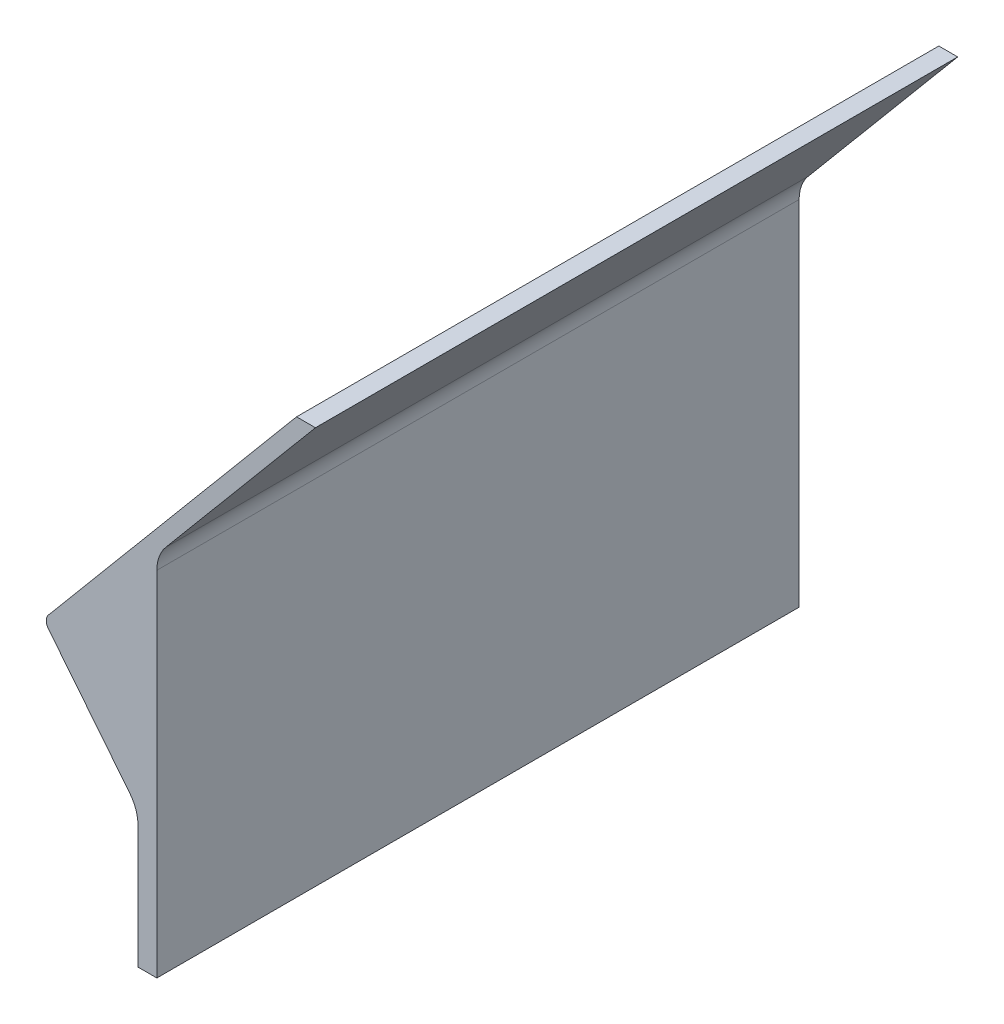
ISO-10303-21;
HEADER;
FILE_DESCRIPTION(('STEP AP214'),'2;1');
FILE_NAME('part.step','',(''),(''),'','','');
FILE_SCHEMA(('AUTOMOTIVE_DESIGN { 1 0 10303 214 1 1 1 1 }'));
ENDSEC;
DATA;
#1=APPLICATION_CONTEXT('core data for automotive mechanical design processes');
#2=APPLICATION_PROTOCOL_DEFINITION('international standard','automotive_design',2000,#1);
#3=PRODUCT_CONTEXT('',#1,'mechanical');
#4=PRODUCT('Part','Part','',(#3));
#5=PRODUCT_RELATED_PRODUCT_CATEGORY('part','',(#4));
#6=PRODUCT_DEFINITION_FORMATION('','',#4);
#7=PRODUCT_DEFINITION_CONTEXT('part definition',#1,'design');
#8=PRODUCT_DEFINITION('design','',#6,#7);
#9=PRODUCT_DEFINITION_SHAPE('','',#8);
#10=(LENGTH_UNIT() NAMED_UNIT(*) SI_UNIT(.MILLI.,.METRE.));
#11=(NAMED_UNIT(*) PLANE_ANGLE_UNIT() SI_UNIT($,.RADIAN.));
#12=(NAMED_UNIT(*) SI_UNIT($,.STERADIAN.) SOLID_ANGLE_UNIT());
#13=UNCERTAINTY_MEASURE_WITH_UNIT(LENGTH_MEASURE(1.E-05),#10,'distance_accuracy_value','');
#14=(GEOMETRIC_REPRESENTATION_CONTEXT(3) GLOBAL_UNCERTAINTY_ASSIGNED_CONTEXT((#13)) GLOBAL_UNIT_ASSIGNED_CONTEXT((#10,
#11,#12)) REPRESENTATION_CONTEXT('',''));
#15=CARTESIAN_POINT('',(0.,0.,0.));
#16=DIRECTION('',(0.,0.,1.));
#17=DIRECTION('',(1.,0.,0.));
#18=AXIS2_PLACEMENT_3D('',#15,#16,#17);
#19=CARTESIAN_POINT('',(-5.,0.,170.));
#20=DIRECTION('',(0.,1.,0.));
#21=DIRECTION('',(-1.,0.,0.));
#22=AXIS2_PLACEMENT_3D('',#19,#20,#21);
#23=PLANE('',#22);
#24=DIRECTION('',(1.,0.,0.));
#25=VECTOR('',#24,1.);
#26=CARTESIAN_POINT('',(-5.,0.,0.));
#27=LINE('',#26,#25);
#28=CARTESIAN_POINT('',(-5.,0.,0.));
#29=VERTEX_POINT('',#28);
#30=CARTESIAN_POINT('',(0.,0.,0.));
#31=VERTEX_POINT('',#30);
#32=EDGE_CURVE('E143',#29,#31,#27,.T.);
#33=ORIENTED_EDGE('',*,*,#32,.T.);
#34=DIRECTION('',(0.,0.,-1.));
#35=VECTOR('',#34,1.);
#36=CARTESIAN_POINT('',(0.,0.,170.));
#37=LINE('',#36,#35);
#38=CARTESIAN_POINT('',(0.,0.,170.));
#39=VERTEX_POINT('',#38);
#40=EDGE_CURVE('E122',#39,#31,#37,.T.);
#41=ORIENTED_EDGE('',*,*,#40,.F.);
#42=DIRECTION('',(1.,0.,0.));
#43=VECTOR('',#42,1.);
#44=CARTESIAN_POINT('',(-5.,0.,170.));
#45=LINE('',#44,#43);
#46=CARTESIAN_POINT('',(-5.,0.,170.));
#47=VERTEX_POINT('',#46);
#48=EDGE_CURVE('E130',#47,#39,#45,.T.);
#49=ORIENTED_EDGE('',*,*,#48,.F.);
#50=DIRECTION('',(0.,0.,-1.));
#51=VECTOR('',#50,1.);
#52=CARTESIAN_POINT('',(-5.,0.,170.));
#53=LINE('',#52,#51);
#54=EDGE_CURVE('E207',#47,#29,#53,.T.);
#55=ORIENTED_EDGE('',*,*,#54,.T.);
#56=EDGE_LOOP('',(#33,#41,#49,#55));
#57=FACE_BOUND('',#56,.T.);
#58=ADVANCED_FACE('F39',(#57),#23,.F.);
#59=CARTESIAN_POINT('',(0.,0.,170.));
#60=DIRECTION('',(-1.,0.,0.));
#61=DIRECTION('',(0.,0.,1.));
#62=AXIS2_PLACEMENT_3D('',#59,#60,#61);
#63=PLANE('',#62);
#64=DIRECTION('',(0.,1.,0.));
#65=VECTOR('',#64,1.);
#66=CARTESIAN_POINT('',(0.,0.,0.));
#67=LINE('',#66,#65);
#68=CARTESIAN_POINT('',(0.,93.460297657338,0.));
#69=VERTEX_POINT('',#68);
#70=EDGE_CURVE('E221',#31,#69,#67,.T.);
#71=ORIENTED_EDGE('',*,*,#70,.T.);
#72=DIRECTION('',(0.,0.,-1.));
#73=VECTOR('',#72,1.);
#74=CARTESIAN_POINT('',(0.,93.460297657338,170.));
#75=LINE('',#74,#73);
#76=CARTESIAN_POINT('',(0.,93.460297657338,170.));
#77=VERTEX_POINT('',#76);
#78=EDGE_CURVE('E125',#69,#77,#75,.F.);
#79=ORIENTED_EDGE('',*,*,#78,.T.);
#80=DIRECTION('',(0.,1.,0.));
#81=VECTOR('',#80,1.);
#82=CARTESIAN_POINT('',(0.,0.,170.));
#83=LINE('',#82,#81);
#84=EDGE_CURVE('E117',#39,#77,#83,.T.);
#85=ORIENTED_EDGE('',*,*,#84,.F.);
#86=ORIENTED_EDGE('',*,*,#40,.T.);
#87=EDGE_LOOP('',(#71,#79,#85,#86));
#88=FACE_BOUND('',#87,.T.);
#89=ADVANCED_FACE('F120',(#88),#63,.F.);
#90=CARTESIAN_POINT('',(0.,97.1,170.));
#91=DIRECTION('',(-0.766044443118977,0.64278760968654,0.));
#92=DIRECTION('',(-0.64278760968654,-0.766044443118977,0.));
#93=AXIS2_PLACEMENT_3D('',#90,#91,#92);
#94=PLANE('',#93);
#95=DIRECTION('',(0.64278760968654,0.766044443118977,0.));
#96=VECTOR('',#95,1.);
#97=CARTESIAN_POINT('',(0.,97.1,170.));
#98=LINE('',#97,#96);
#99=CARTESIAN_POINT('',(2.33955556881022,99.8881737542034,170.));
#100=VERTEX_POINT('',#99);
#101=CARTESIAN_POINT('',(41.9740309125311,147.122702135669,170.));
#102=VERTEX_POINT('',#101);
#103=EDGE_CURVE('E129',#100,#102,#98,.T.);
#104=ORIENTED_EDGE('',*,*,#103,.F.);
#105=DIRECTION('',(0.,0.,-1.));
#106=VECTOR('',#105,1.);
#107=CARTESIAN_POINT('',(2.33955556881022,99.8881737542034,0.));
#108=LINE('',#107,#106);
#109=CARTESIAN_POINT('',(2.33955556881022,99.8881737542034,0.));
#110=VERTEX_POINT('',#109);
#111=EDGE_CURVE('E161',#100,#110,#108,.T.);
#112=ORIENTED_EDGE('',*,*,#111,.T.);
#113=DIRECTION('',(0.64278760968654,0.766044443118977,0.));
#114=VECTOR('',#113,1.);
#115=CARTESIAN_POINT('',(0.,97.1,0.));
#116=LINE('',#115,#114);
#117=CARTESIAN_POINT('',(41.9740309125311,147.122702135669,0.));
#118=VERTEX_POINT('',#117);
#119=EDGE_CURVE('E218',#110,#118,#116,.T.);
#120=ORIENTED_EDGE('',*,*,#119,.T.);
#121=DIRECTION('',(0.,0.,-1.));
#122=VECTOR('',#121,1.);
#123=CARTESIAN_POINT('',(41.9740309125311,147.122702135669,170.));
#124=LINE('',#123,#122);
#125=EDGE_CURVE('E146',#102,#118,#124,.T.);
#126=ORIENTED_EDGE('',*,*,#125,.F.);
#127=EDGE_LOOP('',(#104,#112,#120,#126));
#128=FACE_BOUND('',#127,.T.);
#129=ADVANCED_FACE('F242',(#128),#94,.F.);
#130=CARTESIAN_POINT('',(41.9740309125311,147.122702135669,170.));
#131=DIRECTION('',(0.,-1.,0.));
#132=DIRECTION('',(1.,0.,0.));
#133=AXIS2_PLACEMENT_3D('',#130,#131,#132);
#134=PLANE('',#133);
#135=DIRECTION('',(-1.,0.,0.));
#136=VECTOR('',#135,1.);
#137=CARTESIAN_POINT('',(41.9740309125311,147.122702135669,0.));
#138=LINE('',#137,#136);
#139=CARTESIAN_POINT('',(36.9740309125311,147.122702135669,0.));
#140=VERTEX_POINT('',#139);
#141=EDGE_CURVE('E203',#118,#140,#138,.T.);
#142=ORIENTED_EDGE('',*,*,#141,.T.);
#143=DIRECTION('',(0.,0.,-1.));
#144=VECTOR('',#143,1.);
#145=CARTESIAN_POINT('',(36.9740309125311,147.122702135669,170.));
#146=LINE('',#145,#144);
#147=CARTESIAN_POINT('',(36.9740309125311,147.122702135669,170.));
#148=VERTEX_POINT('',#147);
#149=EDGE_CURVE('E154',#148,#140,#146,.T.);
#150=ORIENTED_EDGE('',*,*,#149,.F.);
#151=DIRECTION('',(-1.,0.,0.));
#152=VECTOR('',#151,1.);
#153=CARTESIAN_POINT('',(41.9740309125311,147.122702135669,170.));
#154=LINE('',#153,#152);
#155=EDGE_CURVE('E234',#102,#148,#154,.T.);
#156=ORIENTED_EDGE('',*,*,#155,.F.);
#157=ORIENTED_EDGE('',*,*,#125,.T.);
#158=EDGE_LOOP('',(#142,#150,#156,#157));
#159=FACE_BOUND('',#158,.T.);
#160=ADVANCED_FACE('F243',(#159),#134,.F.);
#161=CARTESIAN_POINT('',(36.9740309125311,147.122702135669,170.));
#162=DIRECTION('',(0.766044443118977,-0.64278760968654,0.));
#163=DIRECTION('',(0.642787609686541,0.766044443118977,0.));
#164=AXIS2_PLACEMENT_3D('',#161,#162,#163);
#165=PLANE('',#164);
#166=DIRECTION('',(-0.64278760968654,-0.766044443118977,0.));
#167=VECTOR('',#166,1.);
#168=CARTESIAN_POINT('',(36.9740309125311,147.122702135669,0.));
#169=LINE('',#168,#167);
#170=CARTESIAN_POINT('',(-28.6827852863566,68.8759555523473,0.));
#171=VERTEX_POINT('',#170);
#172=EDGE_CURVE('E198',#140,#171,#169,.T.);
#173=ORIENTED_EDGE('',*,*,#172,.T.);
#174=DIRECTION('',(0.,0.,-1.));
#175=VECTOR('',#174,1.);
#176=CARTESIAN_POINT('',(-28.6827852863566,68.8759555523473,170.));
#177=LINE('',#176,#175);
#178=CARTESIAN_POINT('',(-28.6827852863566,68.8759555523473,170.));
#179=VERTEX_POINT('',#178);
#180=EDGE_CURVE('E48',#171,#179,#177,.F.);
#181=ORIENTED_EDGE('',*,*,#180,.T.);
#182=DIRECTION('',(-0.64278760968654,-0.766044443118977,0.));
#183=VECTOR('',#182,1.);
#184=CARTESIAN_POINT('',(36.9740309125311,147.122702135669,170.));
#185=LINE('',#184,#183);
#186=EDGE_CURVE('E213',#148,#179,#185,.T.);
#187=ORIENTED_EDGE('',*,*,#186,.F.);
#188=ORIENTED_EDGE('',*,*,#149,.T.);
#189=EDGE_LOOP('',(#173,#181,#187,#188));
#190=FACE_BOUND('',#189,.T.);
#191=ADVANCED_FACE('F212',(#190),#165,.F.);
#192=CARTESIAN_POINT('',(-30.,67.3061601851448,170.));
#193=DIRECTION('',(0.7806247497998,0.625,0.));
#194=DIRECTION('',(-0.625,0.7806247497998,0.));
#195=AXIS2_PLACEMENT_3D('',#192,#193,#194);
#196=PLANE('',#195);
#197=DIRECTION('',(0.625,-0.7806247497998,0.));
#198=VECTOR('',#197,1.);
#199=CARTESIAN_POINT('',(-30.,67.3061601851448,170.));
#200=LINE('',#199,#198);
#201=CARTESIAN_POINT('',(-28.7192360530587,65.706486528131,170.));
#202=VERTEX_POINT('',#201);
#203=CARTESIAN_POINT('',(-7.19375250200201,38.8211661899497,170.));
#204=VERTEX_POINT('',#203);
#205=EDGE_CURVE('E191',#202,#204,#200,.T.);
#206=ORIENTED_EDGE('',*,*,#205,.F.);
#207=DIRECTION('',(0.,0.,-1.));
#208=VECTOR('',#207,1.);
#209=CARTESIAN_POINT('',(-28.7192360530587,65.706486528131,170.));
#210=LINE('',#209,#208);
#211=CARTESIAN_POINT('',(-28.7192360530587,65.706486528131,0.));
#212=VERTEX_POINT('',#211);
#213=EDGE_CURVE('E180',#202,#212,#210,.T.);
#214=ORIENTED_EDGE('',*,*,#213,.T.);
#215=DIRECTION('',(0.625,-0.7806247497998,0.));
#216=VECTOR('',#215,1.);
#217=CARTESIAN_POINT('',(-30.,67.3061601851448,0.));
#218=LINE('',#217,#216);
#219=CARTESIAN_POINT('',(-7.19375250200201,38.8211661899497,0.));
#220=VERTEX_POINT('',#219);
#221=EDGE_CURVE('E190',#212,#220,#218,.T.);
#222=ORIENTED_EDGE('',*,*,#221,.T.);
#223=DIRECTION('',(0.,0.,-1.));
#224=VECTOR('',#223,1.);
#225=CARTESIAN_POINT('',(-7.19375250200201,38.8211661899497,170.));
#226=LINE('',#225,#224);
#227=EDGE_CURVE('E151',#220,#204,#226,.F.);
#228=ORIENTED_EDGE('',*,*,#227,.T.);
#229=EDGE_LOOP('',(#206,#214,#222,#228));
#230=FACE_BOUND('',#229,.T.);
#231=ADVANCED_FACE('F189',(#230),#196,.F.);
#232=CARTESIAN_POINT('',(-5.,36.0811701931529,170.));
#233=DIRECTION('',(1.,0.,0.));
#234=DIRECTION('',(0.,1.,0.));
#235=AXIS2_PLACEMENT_3D('',#232,#233,#234);
#236=PLANE('',#235);
#237=DIRECTION('',(0.,-1.,0.));
#238=VECTOR('',#237,1.);
#239=CARTESIAN_POINT('',(-5.,36.0811701931529,170.));
#240=LINE('',#239,#238);
#241=CARTESIAN_POINT('',(-5.,32.5711661899497,170.));
#242=VERTEX_POINT('',#241);
#243=EDGE_CURVE('E135',#242,#47,#240,.T.);
#244=ORIENTED_EDGE('',*,*,#243,.F.);
#245=DIRECTION('',(0.,0.,-1.));
#246=VECTOR('',#245,1.);
#247=CARTESIAN_POINT('',(-5.,32.5711661899497,0.));
#248=LINE('',#247,#246);
#249=CARTESIAN_POINT('',(-5.,32.5711661899497,0.));
#250=VERTEX_POINT('',#249);
#251=EDGE_CURVE('E145',#242,#250,#248,.T.);
#252=ORIENTED_EDGE('',*,*,#251,.T.);
#253=DIRECTION('',(0.,-1.,0.));
#254=VECTOR('',#253,1.);
#255=CARTESIAN_POINT('',(-5.,36.0811701931529,0.));
#256=LINE('',#255,#254);
#257=EDGE_CURVE('E140',#250,#29,#256,.T.);
#258=ORIENTED_EDGE('',*,*,#257,.T.);
#259=ORIENTED_EDGE('',*,*,#54,.F.);
#260=EDGE_LOOP('',(#244,#252,#258,#259));
#261=FACE_BOUND('',#260,.T.);
#262=ADVANCED_FACE('F269',(#261),#236,.F.);
#263=CARTESIAN_POINT('',(0.,0.,170.));
#264=DIRECTION('',(0.,0.,1.));
#265=DIRECTION('',(1.,0.,0.));
#266=AXIS2_PLACEMENT_3D('',#263,#264,#265);
#267=PLANE('',#266);
#268=ORIENTED_EDGE('',*,*,#186,.T.);
#269=CARTESIAN_POINT('',(-26.7676741785592,67.2689865281309,170.));
#270=DIRECTION('',(0.,0.,1.));
#271=DIRECTION('',(1.,0.,0.));
#272=AXIS2_PLACEMENT_3D('',#269,#270,#271);
#273=CIRCLE('',#272,2.5);
#274=EDGE_CURVE('E11',#179,#202,#273,.T.);
#275=ORIENTED_EDGE('',*,*,#274,.T.);
#276=ORIENTED_EDGE('',*,*,#205,.T.);
#277=CARTESIAN_POINT('',(-15.,32.5711661899497,170.));
#278=DIRECTION('',(0.,0.,1.));
#279=DIRECTION('',(1.,0.,0.));
#280=AXIS2_PLACEMENT_3D('',#277,#278,#279);
#281=CIRCLE('',#280,10.);
#282=EDGE_CURVE('E171',#204,#242,#281,.F.);
#283=ORIENTED_EDGE('',*,*,#282,.T.);
#284=ORIENTED_EDGE('',*,*,#243,.T.);
#285=ORIENTED_EDGE('',*,*,#48,.T.);
#286=ORIENTED_EDGE('',*,*,#84,.T.);
#287=CARTESIAN_POINT('',(10.,93.460297657338,170.));
#288=DIRECTION('',(0.,0.,1.));
#289=DIRECTION('',(1.,0.,0.));
#290=AXIS2_PLACEMENT_3D('',#287,#288,#289);
#291=CIRCLE('',#290,10.);
#292=EDGE_CURVE('E177',#77,#100,#291,.F.);
#293=ORIENTED_EDGE('',*,*,#292,.T.);
#294=ORIENTED_EDGE('',*,*,#103,.T.);
#295=ORIENTED_EDGE('',*,*,#155,.T.);
#296=EDGE_LOOP('',(#268,#275,#276,#283,#284,#285,#286,#293,#294,#295));
#297=FACE_BOUND('',#296,.T.);
#298=ADVANCED_FACE('F133',(#297),#267,.T.);
#299=CARTESIAN_POINT('',(0.,0.,0.));
#300=DIRECTION('',(0.,0.,1.));
#301=DIRECTION('',(1.,0.,0.));
#302=AXIS2_PLACEMENT_3D('',#299,#300,#301);
#303=PLANE('',#302);
#304=ORIENTED_EDGE('',*,*,#221,.F.);
#305=CARTESIAN_POINT('',(-26.7676741785592,67.2689865281309,0.));
#306=DIRECTION('',(0.,0.,1.));
#307=DIRECTION('',(1.,0.,0.));
#308=AXIS2_PLACEMENT_3D('',#305,#306,#307);
#309=CIRCLE('',#308,2.5);
#310=EDGE_CURVE('E62',#212,#171,#309,.F.);
#311=ORIENTED_EDGE('',*,*,#310,.T.);
#312=ORIENTED_EDGE('',*,*,#172,.F.);
#313=ORIENTED_EDGE('',*,*,#141,.F.);
#314=ORIENTED_EDGE('',*,*,#119,.F.);
#315=CARTESIAN_POINT('',(10.,93.460297657338,0.));
#316=DIRECTION('',(0.,0.,1.));
#317=DIRECTION('',(1.,0.,0.));
#318=AXIS2_PLACEMENT_3D('',#315,#316,#317);
#319=CIRCLE('',#318,10.);
#320=EDGE_CURVE('E174',#110,#69,#319,.T.);
#321=ORIENTED_EDGE('',*,*,#320,.T.);
#322=ORIENTED_EDGE('',*,*,#70,.F.);
#323=ORIENTED_EDGE('',*,*,#32,.F.);
#324=ORIENTED_EDGE('',*,*,#257,.F.);
#325=CARTESIAN_POINT('',(-15.,32.5711661899497,0.));
#326=DIRECTION('',(0.,0.,1.));
#327=DIRECTION('',(1.,0.,0.));
#328=AXIS2_PLACEMENT_3D('',#325,#326,#327);
#329=CIRCLE('',#328,10.);
#330=EDGE_CURVE('E167',#250,#220,#329,.T.);
#331=ORIENTED_EDGE('',*,*,#330,.T.);
#332=EDGE_LOOP('',(#304,#311,#312,#313,#314,#321,#322,#323,#324,#331));
#333=FACE_BOUND('',#332,.T.);
#334=ADVANCED_FACE('F194',(#333),#303,.F.);
#335=CARTESIAN_POINT('',(-15.,32.5711661899497,170.));
#336=DIRECTION('',(0.,0.,1.));
#337=DIRECTION('',(1.,0.,0.));
#338=AXIS2_PLACEMENT_3D('',#335,#336,#337);
#339=CYLINDRICAL_SURFACE('',#338,10.);
#340=ORIENTED_EDGE('',*,*,#282,.F.);
#341=ORIENTED_EDGE('',*,*,#227,.F.);
#342=ORIENTED_EDGE('',*,*,#330,.F.);
#343=ORIENTED_EDGE('',*,*,#251,.F.);
#344=EDGE_LOOP('',(#340,#341,#342,#343));
#345=FACE_BOUND('',#344,.T.);
#346=ADVANCED_FACE('F259',(#345),#339,.F.);
#347=CARTESIAN_POINT('',(10.,93.460297657338,170.));
#348=DIRECTION('',(0.,0.,1.));
#349=DIRECTION('',(1.,0.,0.));
#350=AXIS2_PLACEMENT_3D('',#347,#348,#349);
#351=CYLINDRICAL_SURFACE('',#350,10.);
#352=ORIENTED_EDGE('',*,*,#292,.F.);
#353=ORIENTED_EDGE('',*,*,#78,.F.);
#354=ORIENTED_EDGE('',*,*,#320,.F.);
#355=ORIENTED_EDGE('',*,*,#111,.F.);
#356=EDGE_LOOP('',(#352,#353,#354,#355));
#357=FACE_BOUND('',#356,.T.);
#358=ADVANCED_FACE('F261',(#357),#351,.F.);
#359=CARTESIAN_POINT('',(-26.7676741785592,67.2689865281309,170.));
#360=DIRECTION('',(0.,0.,-1.));
#361=DIRECTION('',(-1.,0.,0.));
#362=AXIS2_PLACEMENT_3D('',#359,#360,#361);
#363=CYLINDRICAL_SURFACE('',#362,2.5);
#364=ORIENTED_EDGE('',*,*,#274,.F.);
#365=ORIENTED_EDGE('',*,*,#180,.F.);
#366=ORIENTED_EDGE('',*,*,#310,.F.);
#367=ORIENTED_EDGE('',*,*,#213,.F.);
#368=EDGE_LOOP('',(#364,#365,#366,#367));
#369=FACE_BOUND('',#368,.T.);
#370=ADVANCED_FACE('F41',(#369),#363,.T.);
#371=CLOSED_SHELL('',(#58,#89,#129,#160,#191,#231,#262,#298,#334,#346,#358,#370));
#372=MANIFOLD_SOLID_BREP('B2',#371);
#373=ADVANCED_BREP_SHAPE_REPRESENTATION('',(#18,#372),#14);
#374=SHAPE_DEFINITION_REPRESENTATION(#9,#373);
ENDSEC;
END-ISO-10303-21;
